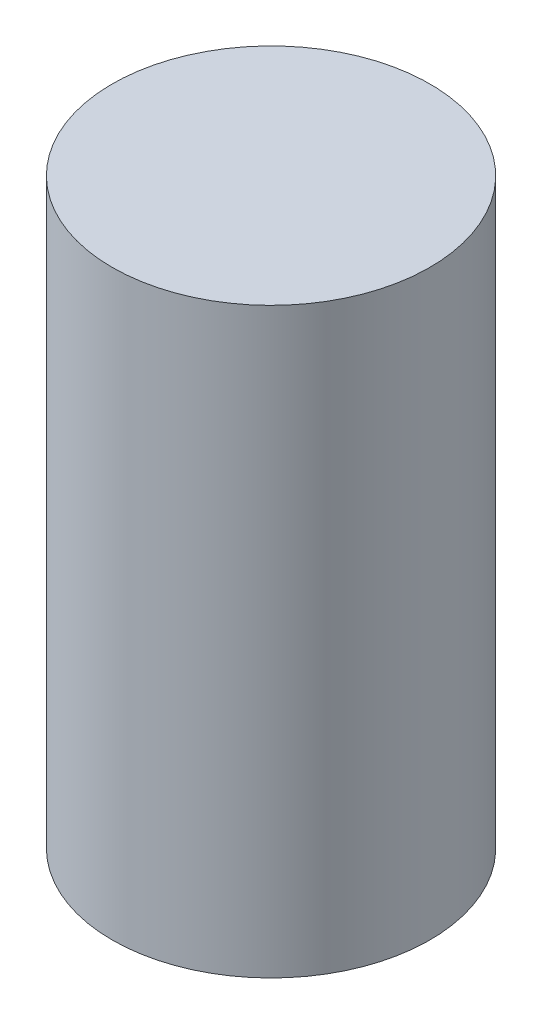
ISO-10303-21;
HEADER;
FILE_DESCRIPTION(('STEP AP214'),'2;1');
FILE_NAME('part.step','',(''),(''),'','','');
FILE_SCHEMA(('AUTOMOTIVE_DESIGN { 1 0 10303 214 1 1 1 1 }'));
ENDSEC;
DATA;
#1=APPLICATION_CONTEXT('core data for automotive mechanical design processes');
#2=APPLICATION_PROTOCOL_DEFINITION('international standard','automotive_design',2000,#1);
#3=PRODUCT_CONTEXT('',#1,'mechanical');
#4=PRODUCT('Part','Part','',(#3));
#5=PRODUCT_RELATED_PRODUCT_CATEGORY('part','',(#4));
#6=PRODUCT_DEFINITION_FORMATION('','',#4);
#7=PRODUCT_DEFINITION_CONTEXT('part definition',#1,'design');
#8=PRODUCT_DEFINITION('design','',#6,#7);
#9=PRODUCT_DEFINITION_SHAPE('','',#8);
#10=(LENGTH_UNIT() NAMED_UNIT(*) SI_UNIT(.MILLI.,.METRE.));
#11=(NAMED_UNIT(*) PLANE_ANGLE_UNIT() SI_UNIT($,.RADIAN.));
#12=(NAMED_UNIT(*) SI_UNIT($,.STERADIAN.) SOLID_ANGLE_UNIT());
#13=UNCERTAINTY_MEASURE_WITH_UNIT(LENGTH_MEASURE(1.E-05),#10,'distance_accuracy_value','');
#14=(GEOMETRIC_REPRESENTATION_CONTEXT(3) GLOBAL_UNCERTAINTY_ASSIGNED_CONTEXT((#13)) GLOBAL_UNIT_ASSIGNED_CONTEXT((#10,
#11,#12)) REPRESENTATION_CONTEXT('',''));
#15=CARTESIAN_POINT('',(0.,0.,0.));
#16=DIRECTION('',(0.,0.,1.));
#17=DIRECTION('',(1.,0.,0.));
#18=AXIS2_PLACEMENT_3D('',#15,#16,#17);
#19=CARTESIAN_POINT('',(0.,11.,0.));
#20=DIRECTION('',(0.,-1.,0.));
#21=DIRECTION('',(0.,0.,-1.));
#22=AXIS2_PLACEMENT_3D('',#19,#20,#21);
#23=CYLINDRICAL_SURFACE('',#22,3.);
#24=CARTESIAN_POINT('',(0.,11.,0.));
#25=DIRECTION('',(0.,1.,0.));
#26=DIRECTION('',(0.,0.,1.));
#27=AXIS2_PLACEMENT_3D('',#24,#25,#26);
#28=CIRCLE('',#27,3.);
#29=CARTESIAN_POINT('',(0.,11.,3.));
#30=VERTEX_POINT('',#29);
#31=EDGE_CURVE('E10',#30,#30,#28,.T.);
#32=ORIENTED_EDGE('',*,*,#31,.F.);
#33=EDGE_LOOP('',(#32));
#34=FACE_BOUND('',#33,.T.);
#35=CARTESIAN_POINT('',(0.,0.,0.));
#36=DIRECTION('',(0.,1.,0.));
#37=DIRECTION('',(0.,0.,1.));
#38=AXIS2_PLACEMENT_3D('',#35,#36,#37);
#39=CIRCLE('',#38,3.);
#40=CARTESIAN_POINT('',(0.,0.,3.));
#41=VERTEX_POINT('',#40);
#42=EDGE_CURVE('E35',#41,#41,#39,.T.);
#43=ORIENTED_EDGE('',*,*,#42,.T.);
#44=EDGE_LOOP('',(#43));
#45=FACE_BOUND('',#44,.T.);
#46=ADVANCED_FACE('F32',(#34,#45),#23,.T.);
#47=CARTESIAN_POINT('',(0.,11.,0.));
#48=DIRECTION('',(0.,1.,0.));
#49=DIRECTION('',(0.,0.,1.));
#50=AXIS2_PLACEMENT_3D('',#47,#48,#49);
#51=PLANE('',#50);
#52=ORIENTED_EDGE('',*,*,#31,.T.);
#53=EDGE_LOOP('',(#52));
#54=FACE_BOUND('',#53,.T.);
#55=ADVANCED_FACE('F47',(#54),#51,.T.);
#56=CARTESIAN_POINT('',(0.,0.,0.));
#57=DIRECTION('',(0.,1.,0.));
#58=DIRECTION('',(0.,0.,1.));
#59=AXIS2_PLACEMENT_3D('',#56,#57,#58);
#60=PLANE('',#59);
#61=ORIENTED_EDGE('',*,*,#42,.F.);
#62=EDGE_LOOP('',(#61));
#63=FACE_BOUND('',#62,.T.);
#64=ADVANCED_FACE('F45',(#63),#60,.F.);
#65=CLOSED_SHELL('',(#46,#55,#64));
#66=MANIFOLD_SOLID_BREP('B2',#65);
#67=ADVANCED_BREP_SHAPE_REPRESENTATION('',(#18,#66),#14);
#68=SHAPE_DEFINITION_REPRESENTATION(#9,#67);
ENDSEC;
END-ISO-10303-21;
